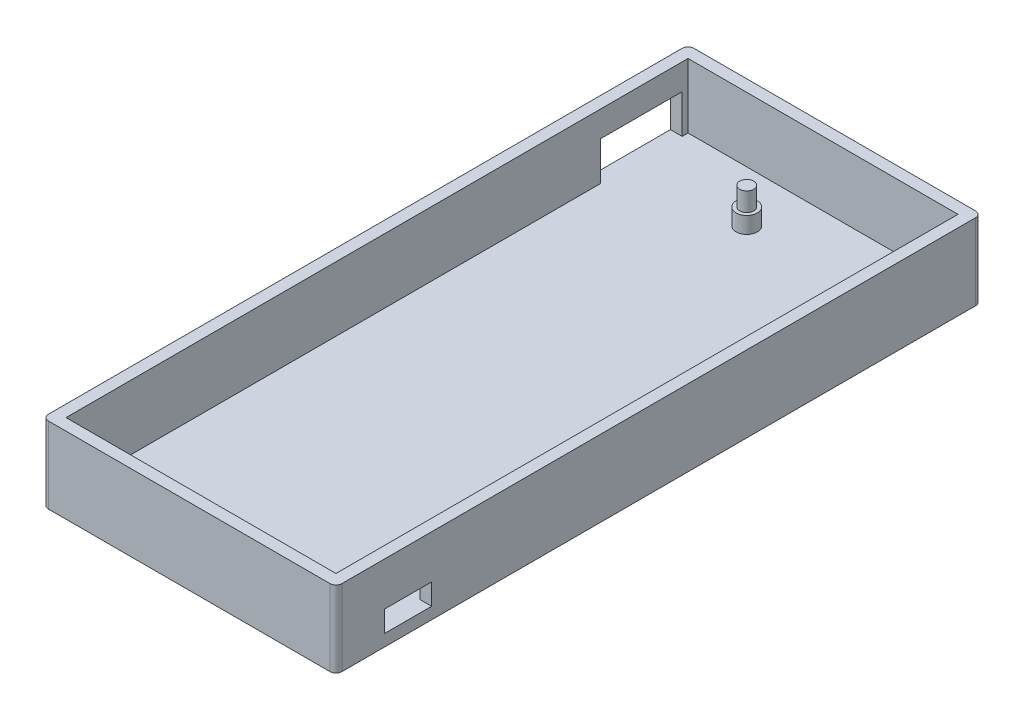
ISO-10303-21;
HEADER;
FILE_DESCRIPTION(('STEP AP214'),'2;1');
FILE_NAME('part.step','',(''),(''),'','','');
FILE_SCHEMA(('AUTOMOTIVE_DESIGN { 1 0 10303 214 1 1 1 1 }'));
ENDSEC;
DATA;
#1=APPLICATION_CONTEXT('core data for automotive mechanical design processes');
#2=APPLICATION_PROTOCOL_DEFINITION('international standard','automotive_design',2000,#1);
#3=PRODUCT_CONTEXT('',#1,'mechanical');
#4=PRODUCT('Part','Part','',(#3));
#5=PRODUCT_RELATED_PRODUCT_CATEGORY('part','',(#4));
#6=PRODUCT_DEFINITION_FORMATION('','',#4);
#7=PRODUCT_DEFINITION_CONTEXT('part definition',#1,'design');
#8=PRODUCT_DEFINITION('design','',#6,#7);
#9=PRODUCT_DEFINITION_SHAPE('','',#8);
#10=(LENGTH_UNIT() NAMED_UNIT(*) SI_UNIT(.MILLI.,.METRE.));
#11=(NAMED_UNIT(*) PLANE_ANGLE_UNIT() SI_UNIT($,.RADIAN.));
#12=(NAMED_UNIT(*) SI_UNIT($,.STERADIAN.) SOLID_ANGLE_UNIT());
#13=UNCERTAINTY_MEASURE_WITH_UNIT(LENGTH_MEASURE(1.E-05),#10,'distance_accuracy_value','');
#14=(GEOMETRIC_REPRESENTATION_CONTEXT(3) GLOBAL_UNCERTAINTY_ASSIGNED_CONTEXT((#13)) GLOBAL_UNIT_ASSIGNED_CONTEXT((#10,
#11,#12)) REPRESENTATION_CONTEXT('',''));
#15=CARTESIAN_POINT('',(0.,0.,0.));
#16=DIRECTION('',(0.,0.,1.));
#17=DIRECTION('',(1.,0.,0.));
#18=AXIS2_PLACEMENT_3D('',#15,#16,#17);
#19=CARTESIAN_POINT('',(0.,13.,0.));
#20=DIRECTION('',(0.,1.,0.));
#21=DIRECTION('',(0.,0.,1.));
#22=AXIS2_PLACEMENT_3D('',#19,#20,#21);
#23=PLANE('',#22);
#24=DIRECTION('',(0.,0.,1.));
#25=VECTOR('',#24,1.);
#26=CARTESIAN_POINT('',(-75.0225872689938,13.,-51.0800821355236));
#27=LINE('',#26,#25);
#28=CARTESIAN_POINT('',(-75.0225872689938,13.,-51.0800821355236));
#29=VERTEX_POINT('',#28);
#30=CARTESIAN_POINT('',(-75.0225872689938,13.,54.9199178644764));
#31=VERTEX_POINT('',#30);
#32=EDGE_CURVE('E459',#29,#31,#27,.T.);
#33=ORIENTED_EDGE('',*,*,#32,.F.);
#34=DIRECTION('',(-1.,0.,0.));
#35=VECTOR('',#34,1.);
#36=CARTESIAN_POINT('',(-75.0225872689938,13.,-51.0800821355236));
#37=LINE('',#36,#35);
#38=CARTESIAN_POINT('',(-29.0225872689938,13.,-51.0800821355236));
#39=VERTEX_POINT('',#38);
#40=EDGE_CURVE('E331',#39,#29,#37,.T.);
#41=ORIENTED_EDGE('',*,*,#40,.F.);
#42=DIRECTION('',(0.,0.,-1.));
#43=VECTOR('',#42,1.);
#44=CARTESIAN_POINT('',(-29.0225872689938,13.,-51.0800821355236));
#45=LINE('',#44,#43);
#46=CARTESIAN_POINT('',(-29.0225872689938,13.,54.9199178644764));
#47=VERTEX_POINT('',#46);
#48=EDGE_CURVE('E336',#47,#39,#45,.T.);
#49=ORIENTED_EDGE('',*,*,#48,.F.);
#50=DIRECTION('',(1.,0.,0.));
#51=VECTOR('',#50,1.);
#52=CARTESIAN_POINT('',(-75.0225872689938,13.,54.9199178644764));
#53=LINE('',#52,#51);
#54=EDGE_CURVE('E461',#31,#47,#53,.T.);
#55=ORIENTED_EDGE('',*,*,#54,.F.);
#56=EDGE_LOOP('',(#33,#41,#49,#55));
#57=FACE_BOUND('',#56,.T.);
#58=DIRECTION('',(-1.,0.,0.));
#59=VECTOR('',#58,1.);
#60=CARTESIAN_POINT('',(-28.0225872689938,13.,-53.0800821355236));
#61=LINE('',#60,#59);
#62=CARTESIAN_POINT('',(-28.0225872689938,13.,-53.0800821355236));
#63=VERTEX_POINT('',#62);
#64=CARTESIAN_POINT('',(-76.0225872689938,13.,-53.0800821355236));
#65=VERTEX_POINT('',#64);
#66=EDGE_CURVE('E530',#63,#65,#61,.T.);
#67=ORIENTED_EDGE('',*,*,#66,.T.);
#68=CARTESIAN_POINT('',(-76.0225872689938,13.,-52.0800821355236));
#69=DIRECTION('',(0.,1.,0.));
#70=DIRECTION('',(0.,0.,1.));
#71=AXIS2_PLACEMENT_3D('',#68,#69,#70);
#72=CIRCLE('',#71,1.00000000000001);
#73=CARTESIAN_POINT('',(-77.0225872689938,13.,-52.0800821355236));
#74=VERTEX_POINT('',#73);
#75=EDGE_CURVE('E390',#65,#74,#72,.T.);
#76=ORIENTED_EDGE('',*,*,#75,.T.);
#77=DIRECTION('',(0.,0.,1.));
#78=VECTOR('',#77,1.);
#79=CARTESIAN_POINT('',(-77.0225872689938,13.,-52.0800821355236));
#80=LINE('',#79,#78);
#81=CARTESIAN_POINT('',(-77.0225872689938,13.,55.9199178644764));
#82=VERTEX_POINT('',#81);
#83=EDGE_CURVE('E509',#74,#82,#80,.T.);
#84=ORIENTED_EDGE('',*,*,#83,.T.);
#85=CARTESIAN_POINT('',(-76.0225872689938,13.,55.9199178644764));
#86=DIRECTION('',(0.,1.,0.));
#87=DIRECTION('',(0.,0.,1.));
#88=AXIS2_PLACEMENT_3D('',#85,#86,#87);
#89=CIRCLE('',#88,1.);
#90=CARTESIAN_POINT('',(-76.0225872689938,13.,56.9199178644764));
#91=VERTEX_POINT('',#90);
#92=EDGE_CURVE('E168',#82,#91,#89,.T.);
#93=ORIENTED_EDGE('',*,*,#92,.T.);
#94=DIRECTION('',(1.,0.,0.));
#95=VECTOR('',#94,1.);
#96=CARTESIAN_POINT('',(-76.0225872689938,13.,56.9199178644764));
#97=LINE('',#96,#95);
#98=CARTESIAN_POINT('',(-28.0225872689938,13.,56.9199178644764));
#99=VERTEX_POINT('',#98);
#100=EDGE_CURVE('E518',#91,#99,#97,.T.);
#101=ORIENTED_EDGE('',*,*,#100,.T.);
#102=CARTESIAN_POINT('',(-28.0225872689938,13.,55.9199178644764));
#103=DIRECTION('',(0.,1.,0.));
#104=DIRECTION('',(0.,0.,1.));
#105=AXIS2_PLACEMENT_3D('',#102,#103,#104);
#106=CIRCLE('',#105,1.);
#107=CARTESIAN_POINT('',(-27.0225872689938,13.,55.9199178644764));
#108=VERTEX_POINT('',#107);
#109=EDGE_CURVE('E521',#99,#108,#106,.T.);
#110=ORIENTED_EDGE('',*,*,#109,.T.);
#111=DIRECTION('',(0.,0.,-1.));
#112=VECTOR('',#111,1.);
#113=CARTESIAN_POINT('',(-27.0225872689938,13.,55.9199178644764));
#114=LINE('',#113,#112);
#115=CARTESIAN_POINT('',(-27.0225872689938,13.,-52.0800821355236));
#116=VERTEX_POINT('',#115);
#117=EDGE_CURVE('E524',#108,#116,#114,.T.);
#118=ORIENTED_EDGE('',*,*,#117,.T.);
#119=CARTESIAN_POINT('',(-28.0225872689938,13.,-52.0800821355236));
#120=DIRECTION('',(0.,1.,0.));
#121=DIRECTION('',(0.,0.,1.));
#122=AXIS2_PLACEMENT_3D('',#119,#120,#121);
#123=CIRCLE('',#122,1.);
#124=EDGE_CURVE('E527',#116,#63,#123,.T.);
#125=ORIENTED_EDGE('',*,*,#124,.T.);
#126=EDGE_LOOP('',(#67,#76,#84,#93,#101,#110,#118,#125));
#127=FACE_BOUND('',#126,.T.);
#128=ADVANCED_FACE('F153',(#57,#127),#23,.T.);
#129=CARTESIAN_POINT('',(0.,2.,0.));
#130=DIRECTION('',(0.,1.,0.));
#131=DIRECTION('',(0.,0.,1.));
#132=AXIS2_PLACEMENT_3D('',#129,#130,#131);
#133=PLANE('',#132);
#134=DIRECTION('',(0.,0.,1.));
#135=VECTOR('',#134,1.);
#136=CARTESIAN_POINT('',(-75.0225872689938,2.,-51.0800821355236));
#137=LINE('',#136,#135);
#138=CARTESIAN_POINT('',(-75.0225872689938,2.,-51.0800821355236));
#139=VERTEX_POINT('',#138);
#140=CARTESIAN_POINT('',(-75.0225872689938,2.,-50.0800821355236));
#141=VERTEX_POINT('',#140);
#142=EDGE_CURVE('E318',#139,#141,#137,.T.);
#143=ORIENTED_EDGE('',*,*,#142,.T.);
#144=DIRECTION('',(-1.,0.,0.));
#145=VECTOR('',#144,1.);
#146=CARTESIAN_POINT('',(-75.0225872689938,2.,-50.0800821355236));
#147=LINE('',#146,#145);
#148=CARTESIAN_POINT('',(-77.0225872689938,2.,-50.0800821355236));
#149=VERTEX_POINT('',#148);
#150=EDGE_CURVE('E420',#141,#149,#147,.T.);
#151=ORIENTED_EDGE('',*,*,#150,.T.);
#152=DIRECTION('',(0.,0.,1.));
#153=VECTOR('',#152,1.);
#154=CARTESIAN_POINT('',(-77.0225872689938,2.,0.));
#155=LINE('',#154,#153);
#156=CARTESIAN_POINT('',(-77.0225872689938,2.,-36.1800821355236));
#157=VERTEX_POINT('',#156);
#158=EDGE_CURVE('E299',#149,#157,#155,.T.);
#159=ORIENTED_EDGE('',*,*,#158,.T.);
#160=DIRECTION('',(-1.,0.,0.));
#161=VECTOR('',#160,1.);
#162=CARTESIAN_POINT('',(-75.0225872689938,2.,-36.1800821355236));
#163=LINE('',#162,#161);
#164=CARTESIAN_POINT('',(-75.0225872689938,2.,-36.1800821355236));
#165=VERTEX_POINT('',#164);
#166=EDGE_CURVE('E289',#165,#157,#163,.T.);
#167=ORIENTED_EDGE('',*,*,#166,.F.);
#168=CARTESIAN_POINT('',(-75.0225872689938,2.,54.9199178644764));
#169=VERTEX_POINT('',#168);
#170=EDGE_CURVE('E296',#165,#169,#137,.T.);
#171=ORIENTED_EDGE('',*,*,#170,.T.);
#172=DIRECTION('',(1.,0.,0.));
#173=VECTOR('',#172,1.);
#174=CARTESIAN_POINT('',(-75.0225872689938,2.,54.9199178644764));
#175=LINE('',#174,#173);
#176=CARTESIAN_POINT('',(-29.0225872689938,2.,54.9199178644764));
#177=VERTEX_POINT('',#176);
#178=EDGE_CURVE('E321',#169,#177,#175,.T.);
#179=ORIENTED_EDGE('',*,*,#178,.T.);
#180=DIRECTION('',(0.,0.,-1.));
#181=VECTOR('',#180,1.);
#182=CARTESIAN_POINT('',(-29.0225872689938,2.,-51.0800821355236));
#183=LINE('',#182,#181);
#184=CARTESIAN_POINT('',(-29.0225872689938,2.,48.6199178644764));
#185=VERTEX_POINT('',#184);
#186=EDGE_CURVE('E328',#177,#185,#183,.T.);
#187=ORIENTED_EDGE('',*,*,#186,.T.);
#188=DIRECTION('',(1.,0.,0.));
#189=VECTOR('',#188,1.);
#190=CARTESIAN_POINT('',(-38.8225872689938,2.,48.6199178644764));
#191=LINE('',#190,#189);
#192=CARTESIAN_POINT('',(-27.0225872689938,2.,48.6199178644764));
#193=VERTEX_POINT('',#192);
#194=EDGE_CURVE('E422',#185,#193,#191,.T.);
#195=ORIENTED_EDGE('',*,*,#194,.T.);
#196=DIRECTION('',(0.,0.,-1.));
#197=VECTOR('',#196,1.);
#198=CARTESIAN_POINT('',(-27.0225872689938,2.,0.));
#199=LINE('',#198,#197);
#200=CARTESIAN_POINT('',(-27.0225872689938,2.,40.6199178644764));
#201=VERTEX_POINT('',#200);
#202=EDGE_CURVE('E405',#193,#201,#199,.T.);
#203=ORIENTED_EDGE('',*,*,#202,.T.);
#204=DIRECTION('',(1.,0.,0.));
#205=VECTOR('',#204,1.);
#206=CARTESIAN_POINT('',(-38.8225872689938,2.,40.6199178644764));
#207=LINE('',#206,#205);
#208=CARTESIAN_POINT('',(-29.0225872689938,2.,40.6199178644764));
#209=VERTEX_POINT('',#208);
#210=EDGE_CURVE('E430',#209,#201,#207,.T.);
#211=ORIENTED_EDGE('',*,*,#210,.F.);
#212=CARTESIAN_POINT('',(-29.0225872689938,2.,-51.0800821355236));
#213=VERTEX_POINT('',#212);
#214=EDGE_CURVE('E327',#209,#213,#183,.T.);
#215=ORIENTED_EDGE('',*,*,#214,.T.);
#216=DIRECTION('',(-1.,0.,0.));
#217=VECTOR('',#216,1.);
#218=CARTESIAN_POINT('',(-75.0225872689938,2.,-51.0800821355236));
#219=LINE('',#218,#217);
#220=EDGE_CURVE('E319',#213,#139,#219,.T.);
#221=ORIENTED_EDGE('',*,*,#220,.T.);
#222=EDGE_LOOP('',(#143,#151,#159,#167,#171,#179,#187,#195,#203,#211,#215,#221));
#223=FACE_BOUND('',#222,.T.);
#224=CARTESIAN_POINT('',(-31.0225872689938,2.,-42.3800821355236));
#225=DIRECTION('',(0.,1.,0.));
#226=DIRECTION('',(0.,0.,1.));
#227=AXIS2_PLACEMENT_3D('',#224,#225,#226);
#228=CIRCLE('',#227,1.8);
#229=CARTESIAN_POINT('',(-31.0225872689938,2.,-40.5800821355236));
#230=VERTEX_POINT('',#229);
#231=EDGE_CURVE('E441',#230,#230,#228,.T.);
#232=ORIENTED_EDGE('',*,*,#231,.F.);
#233=EDGE_LOOP('',(#232));
#234=FACE_BOUND('',#233,.T.);
#235=CARTESIAN_POINT('',(-56.3225872689938,2.,-42.3800821355236));
#236=DIRECTION('',(0.,1.,0.));
#237=DIRECTION('',(0.,0.,1.));
#238=AXIS2_PLACEMENT_3D('',#235,#236,#237);
#239=CIRCLE('',#238,1.8);
#240=CARTESIAN_POINT('',(-56.3225872689938,2.,-40.5800821355236));
#241=VERTEX_POINT('',#240);
#242=EDGE_CURVE('E359',#241,#241,#239,.T.);
#243=ORIENTED_EDGE('',*,*,#242,.F.);
#244=EDGE_LOOP('',(#243));
#245=FACE_BOUND('',#244,.T.);
#246=CARTESIAN_POINT('',(-31.0225872689938,2.,52.9199178644764));
#247=DIRECTION('',(0.,1.,0.));
#248=DIRECTION('',(0.,0.,1.));
#249=AXIS2_PLACEMENT_3D('',#246,#247,#248);
#250=CIRCLE('',#249,1.8);
#251=CARTESIAN_POINT('',(-31.0225872689938,2.,54.7199178644764));
#252=VERTEX_POINT('',#251);
#253=EDGE_CURVE('E354',#252,#252,#250,.T.);
#254=ORIENTED_EDGE('',*,*,#253,.F.);
#255=EDGE_LOOP('',(#254));
#256=FACE_BOUND('',#255,.T.);
#257=CARTESIAN_POINT('',(-56.3225872689938,2.,52.9199178644764));
#258=DIRECTION('',(0.,1.,0.));
#259=DIRECTION('',(0.,0.,1.));
#260=AXIS2_PLACEMENT_3D('',#257,#258,#259);
#261=CIRCLE('',#260,1.8);
#262=CARTESIAN_POINT('',(-56.3225872689938,2.,54.7199178644764));
#263=VERTEX_POINT('',#262);
#264=EDGE_CURVE('E349',#263,#263,#261,.T.);
#265=ORIENTED_EDGE('',*,*,#264,.F.);
#266=EDGE_LOOP('',(#265));
#267=FACE_BOUND('',#266,.T.);
#268=ADVANCED_FACE('F292',(#223,#234,#245,#256,#267),#133,.T.);
#269=CARTESIAN_POINT('',(-38.8225872689938,2.,48.6199178644764));
#270=DIRECTION('',(0.,0.,1.));
#271=DIRECTION('',(1.,0.,0.));
#272=AXIS2_PLACEMENT_3D('',#269,#270,#271);
#273=PLANE('',#272);
#274=DIRECTION('',(0.,1.,0.));
#275=VECTOR('',#274,1.);
#276=CARTESIAN_POINT('',(-27.0225872689938,2.,48.6199178644764));
#277=LINE('',#276,#275);
#278=CARTESIAN_POINT('',(-27.0225872689938,5.6,48.6199178644764));
#279=VERTEX_POINT('',#278);
#280=EDGE_CURVE('E399',#193,#279,#277,.T.);
#281=ORIENTED_EDGE('',*,*,#280,.F.);
#282=ORIENTED_EDGE('',*,*,#194,.F.);
#283=DIRECTION('',(0.,1.,0.));
#284=VECTOR('',#283,1.);
#285=CARTESIAN_POINT('',(-29.0225872689938,13.,48.6199178644764));
#286=LINE('',#285,#284);
#287=CARTESIAN_POINT('',(-29.0225872689938,5.6,48.6199178644764));
#288=VERTEX_POINT('',#287);
#289=EDGE_CURVE('E439',#185,#288,#286,.T.);
#290=ORIENTED_EDGE('',*,*,#289,.T.);
#291=DIRECTION('',(1.,0.,0.));
#292=VECTOR('',#291,1.);
#293=CARTESIAN_POINT('',(-38.8225872689938,5.6,48.6199178644764));
#294=LINE('',#293,#292);
#295=EDGE_CURVE('E423',#288,#279,#294,.T.);
#296=ORIENTED_EDGE('',*,*,#295,.T.);
#297=EDGE_LOOP('',(#281,#282,#290,#296));
#298=FACE_BOUND('',#297,.T.);
#299=ADVANCED_FACE('F487',(#298),#273,.F.);
#300=CARTESIAN_POINT('',(-38.8225872689938,5.6,48.6199178644764));
#301=DIRECTION('',(0.,1.,0.));
#302=DIRECTION('',(0.,0.,1.));
#303=AXIS2_PLACEMENT_3D('',#300,#301,#302);
#304=PLANE('',#303);
#305=DIRECTION('',(0.,0.,-1.));
#306=VECTOR('',#305,1.);
#307=CARTESIAN_POINT('',(-27.0225872689938,5.6,48.6199178644764));
#308=LINE('',#307,#306);
#309=CARTESIAN_POINT('',(-27.0225872689938,5.6,40.6199178644764));
#310=VERTEX_POINT('',#309);
#311=EDGE_CURVE('E397',#279,#310,#308,.T.);
#312=ORIENTED_EDGE('',*,*,#311,.F.);
#313=ORIENTED_EDGE('',*,*,#295,.F.);
#314=DIRECTION('',(0.,0.,-1.));
#315=VECTOR('',#314,1.);
#316=CARTESIAN_POINT('',(-29.0225872689938,5.6,-51.0800821355236));
#317=LINE('',#316,#315);
#318=CARTESIAN_POINT('',(-29.0225872689938,5.6,40.6199178644764));
#319=VERTEX_POINT('',#318);
#320=EDGE_CURVE('E437',#288,#319,#317,.T.);
#321=ORIENTED_EDGE('',*,*,#320,.T.);
#322=DIRECTION('',(1.,0.,0.));
#323=VECTOR('',#322,1.);
#324=CARTESIAN_POINT('',(-38.8225872689938,5.6,40.6199178644764));
#325=LINE('',#324,#323);
#326=EDGE_CURVE('E427',#319,#310,#325,.T.);
#327=ORIENTED_EDGE('',*,*,#326,.T.);
#328=EDGE_LOOP('',(#312,#313,#321,#327));
#329=FACE_BOUND('',#328,.T.);
#330=ADVANCED_FACE('F490',(#329),#304,.F.);
#331=CARTESIAN_POINT('',(-38.8225872689938,2.,40.6199178644764));
#332=DIRECTION('',(0.,0.,-1.));
#333=DIRECTION('',(-1.,0.,0.));
#334=AXIS2_PLACEMENT_3D('',#331,#332,#333);
#335=PLANE('',#334);
#336=DIRECTION('',(0.,-1.,0.));
#337=VECTOR('',#336,1.);
#338=CARTESIAN_POINT('',(-27.0225872689938,2.,40.6199178644764));
#339=LINE('',#338,#337);
#340=EDGE_CURVE('E342',#310,#201,#339,.T.);
#341=ORIENTED_EDGE('',*,*,#340,.F.);
#342=ORIENTED_EDGE('',*,*,#326,.F.);
#343=DIRECTION('',(0.,-1.,0.));
#344=VECTOR('',#343,1.);
#345=CARTESIAN_POINT('',(-29.0225872689938,13.,40.6199178644764));
#346=LINE('',#345,#344);
#347=EDGE_CURVE('E426',#319,#209,#346,.T.);
#348=ORIENTED_EDGE('',*,*,#347,.T.);
#349=ORIENTED_EDGE('',*,*,#210,.T.);
#350=EDGE_LOOP('',(#341,#342,#348,#349));
#351=FACE_BOUND('',#350,.T.);
#352=ADVANCED_FACE('F497',(#351),#335,.F.);
#353=CARTESIAN_POINT('',(-75.0225872689938,7.8,-50.0800821355236));
#354=DIRECTION('',(0.,0.,-1.));
#355=DIRECTION('',(-1.,0.,0.));
#356=AXIS2_PLACEMENT_3D('',#353,#354,#355);
#357=PLANE('',#356);
#358=DIRECTION('',(0.,1.,0.));
#359=VECTOR('',#358,1.);
#360=CARTESIAN_POINT('',(-77.0225872689938,7.8,-50.0800821355236));
#361=LINE('',#360,#359);
#362=CARTESIAN_POINT('',(-77.0225872689938,8.6,-50.0800821355236));
#363=VERTEX_POINT('',#362);
#364=EDGE_CURVE('E392',#149,#363,#361,.T.);
#365=ORIENTED_EDGE('',*,*,#364,.F.);
#366=ORIENTED_EDGE('',*,*,#150,.F.);
#367=DIRECTION('',(0.,-1.,0.));
#368=VECTOR('',#367,1.);
#369=CARTESIAN_POINT('',(-75.0225872689938,7.8,-50.0800821355236));
#370=LINE('',#369,#368);
#371=CARTESIAN_POINT('',(-75.0225872689938,8.6,-50.0800821355236));
#372=VERTEX_POINT('',#371);
#373=EDGE_CURVE('E417',#372,#141,#370,.T.);
#374=ORIENTED_EDGE('',*,*,#373,.F.);
#375=DIRECTION('',(-1.,0.,0.));
#376=VECTOR('',#375,1.);
#377=CARTESIAN_POINT('',(-75.0225872689938,8.6,-50.0800821355236));
#378=LINE('',#377,#376);
#379=EDGE_CURVE('E503',#372,#363,#378,.T.);
#380=ORIENTED_EDGE('',*,*,#379,.T.);
#381=EDGE_LOOP('',(#365,#366,#374,#380));
#382=FACE_BOUND('',#381,.T.);
#383=ADVANCED_FACE('F502',(#382),#357,.F.);
#384=CARTESIAN_POINT('',(-75.0225872689938,13.,-51.0800821355236));
#385=DIRECTION('',(0.,0.,1.));
#386=DIRECTION('',(1.,0.,0.));
#387=AXIS2_PLACEMENT_3D('',#384,#385,#386);
#388=PLANE('',#387);
#389=ORIENTED_EDGE('',*,*,#220,.F.);
#390=DIRECTION('',(0.,-1.,0.));
#391=VECTOR('',#390,1.);
#392=CARTESIAN_POINT('',(-29.0225872689938,13.,-51.0800821355236));
#393=LINE('',#392,#391);
#394=EDGE_CURVE('E332',#39,#213,#393,.T.);
#395=ORIENTED_EDGE('',*,*,#394,.F.);
#396=ORIENTED_EDGE('',*,*,#40,.T.);
#397=DIRECTION('',(0.,-1.,0.));
#398=VECTOR('',#397,1.);
#399=CARTESIAN_POINT('',(-75.0225872689938,13.,-51.0800821355236));
#400=LINE('',#399,#398);
#401=EDGE_CURVE('E339',#29,#139,#400,.T.);
#402=ORIENTED_EDGE('',*,*,#401,.T.);
#403=EDGE_LOOP('',(#389,#395,#396,#402));
#404=FACE_BOUND('',#403,.T.);
#405=ADVANCED_FACE('F474',(#404),#388,.T.);
#406=CARTESIAN_POINT('',(-75.0225872689938,13.,-51.0800821355236));
#407=DIRECTION('',(1.,0.,0.));
#408=DIRECTION('',(0.,0.,-1.));
#409=AXIS2_PLACEMENT_3D('',#406,#407,#408);
#410=PLANE('',#409);
#411=DIRECTION('',(0.,0.,-1.));
#412=VECTOR('',#411,1.);
#413=CARTESIAN_POINT('',(-75.0225872689938,8.6,-50.0800821355236));
#414=LINE('',#413,#412);
#415=CARTESIAN_POINT('',(-75.0225872689938,8.6,-36.1800821355236));
#416=VERTEX_POINT('',#415);
#417=EDGE_CURVE('E304',#416,#372,#414,.T.);
#418=ORIENTED_EDGE('',*,*,#417,.T.);
#419=ORIENTED_EDGE('',*,*,#373,.T.);
#420=ORIENTED_EDGE('',*,*,#142,.F.);
#421=ORIENTED_EDGE('',*,*,#401,.F.);
#422=ORIENTED_EDGE('',*,*,#32,.T.);
#423=DIRECTION('',(0.,-1.,0.));
#424=VECTOR('',#423,1.);
#425=CARTESIAN_POINT('',(-75.0225872689938,13.,54.9199178644764));
#426=LINE('',#425,#424);
#427=EDGE_CURVE('E316',#31,#169,#426,.T.);
#428=ORIENTED_EDGE('',*,*,#427,.T.);
#429=ORIENTED_EDGE('',*,*,#170,.F.);
#430=DIRECTION('',(0.,1.,0.));
#431=VECTOR('',#430,1.);
#432=CARTESIAN_POINT('',(-75.0225872689938,2.,-36.1800821355236));
#433=LINE('',#432,#431);
#434=EDGE_CURVE('E307',#165,#416,#433,.T.);
#435=ORIENTED_EDGE('',*,*,#434,.T.);
#436=EDGE_LOOP('',(#418,#419,#420,#421,#422,#428,#429,#435));
#437=FACE_BOUND('',#436,.T.);
#438=ADVANCED_FACE('F314',(#437),#410,.T.);
#439=CARTESIAN_POINT('',(-75.0225872689938,13.,54.9199178644764));
#440=DIRECTION('',(0.,0.,-1.));
#441=DIRECTION('',(-1.,0.,0.));
#442=AXIS2_PLACEMENT_3D('',#439,#440,#441);
#443=PLANE('',#442);
#444=ORIENTED_EDGE('',*,*,#54,.T.);
#445=DIRECTION('',(0.,-1.,0.));
#446=VECTOR('',#445,1.);
#447=CARTESIAN_POINT('',(-29.0225872689938,13.,54.9199178644764));
#448=LINE('',#447,#446);
#449=EDGE_CURVE('E335',#47,#177,#448,.T.);
#450=ORIENTED_EDGE('',*,*,#449,.T.);
#451=ORIENTED_EDGE('',*,*,#178,.F.);
#452=ORIENTED_EDGE('',*,*,#427,.F.);
#453=EDGE_LOOP('',(#444,#450,#451,#452));
#454=FACE_BOUND('',#453,.T.);
#455=ADVANCED_FACE('F480',(#454),#443,.T.);
#456=CARTESIAN_POINT('',(-29.0225872689938,13.,-51.0800821355236));
#457=DIRECTION('',(-1.,0.,0.));
#458=DIRECTION('',(0.,0.,1.));
#459=AXIS2_PLACEMENT_3D('',#456,#457,#458);
#460=PLANE('',#459);
#461=ORIENTED_EDGE('',*,*,#48,.T.);
#462=ORIENTED_EDGE('',*,*,#394,.T.);
#463=ORIENTED_EDGE('',*,*,#214,.F.);
#464=ORIENTED_EDGE('',*,*,#347,.F.);
#465=ORIENTED_EDGE('',*,*,#320,.F.);
#466=ORIENTED_EDGE('',*,*,#289,.F.);
#467=ORIENTED_EDGE('',*,*,#186,.F.);
#468=ORIENTED_EDGE('',*,*,#449,.F.);
#469=EDGE_LOOP('',(#461,#462,#463,#464,#465,#466,#467,#468));
#470=FACE_BOUND('',#469,.T.);
#471=ADVANCED_FACE('F466',(#470),#460,.T.);
#472=CARTESIAN_POINT('',(-56.3225872689938,4.8,52.9199178644764));
#473=DIRECTION('',(0.,-1.,0.));
#474=DIRECTION('',(0.,0.,-1.));
#475=AXIS2_PLACEMENT_3D('',#472,#473,#474);
#476=CYLINDRICAL_SURFACE('',#475,1.8);
#477=CARTESIAN_POINT('',(-56.3225872689938,4.8,52.9199178644764));
#478=DIRECTION('',(0.,1.,0.));
#479=DIRECTION('',(0.,0.,1.));
#480=AXIS2_PLACEMENT_3D('',#477,#478,#479);
#481=CIRCLE('',#480,1.8);
#482=CARTESIAN_POINT('',(-56.3225872689938,4.8,54.7199178644764));
#483=VERTEX_POINT('',#482);
#484=EDGE_CURVE('E345',#483,#483,#481,.T.);
#485=ORIENTED_EDGE('',*,*,#484,.F.);
#486=EDGE_LOOP('',(#485));
#487=FACE_BOUND('',#486,.T.);
#488=ORIENTED_EDGE('',*,*,#264,.T.);
#489=EDGE_LOOP('',(#488));
#490=FACE_BOUND('',#489,.T.);
#491=ADVANCED_FACE('F573',(#487,#490),#476,.T.);
#492=CARTESIAN_POINT('',(-56.3225872689938,4.8,52.9199178644764));
#493=DIRECTION('',(0.,1.,0.));
#494=DIRECTION('',(0.,0.,1.));
#495=AXIS2_PLACEMENT_3D('',#492,#493,#494);
#496=PLANE('',#495);
#497=CARTESIAN_POINT('',(-56.3225872689938,4.8,52.9199178644764));
#498=DIRECTION('',(0.,1.,0.));
#499=DIRECTION('',(0.,0.,1.));
#500=AXIS2_PLACEMENT_3D('',#497,#498,#499);
#501=CIRCLE('',#500,1.2);
#502=CARTESIAN_POINT('',(-56.3225872689938,4.8,54.1199178644764));
#503=VERTEX_POINT('',#502);
#504=EDGE_CURVE('E322',#503,#503,#501,.T.);
#505=ORIENTED_EDGE('',*,*,#504,.F.);
#506=EDGE_LOOP('',(#505));
#507=FACE_BOUND('',#506,.T.);
#508=ORIENTED_EDGE('',*,*,#484,.T.);
#509=EDGE_LOOP('',(#508));
#510=FACE_BOUND('',#509,.T.);
#511=ADVANCED_FACE('F596',(#507,#510),#496,.T.);
#512=CARTESIAN_POINT('',(-56.3225872689938,13.,52.9199178644764));
#513=DIRECTION('',(0.,-1.,0.));
#514=DIRECTION('',(0.,0.,-1.));
#515=AXIS2_PLACEMENT_3D('',#512,#513,#514);
#516=CYLINDRICAL_SURFACE('',#515,1.2);
#517=CARTESIAN_POINT('',(-56.3225872689938,8.,52.9199178644764));
#518=DIRECTION('',(0.,-1.,0.));
#519=DIRECTION('',(0.,0.,-1.));
#520=AXIS2_PLACEMENT_3D('',#517,#518,#519);
#521=CIRCLE('',#520,1.2);
#522=CARTESIAN_POINT('',(-56.3225872689938,8.,51.7199178644764));
#523=VERTEX_POINT('',#522);
#524=EDGE_CURVE('E414',#523,#523,#521,.T.);
#525=ORIENTED_EDGE('',*,*,#524,.T.);
#526=EDGE_LOOP('',(#525));
#527=FACE_BOUND('',#526,.T.);
#528=ORIENTED_EDGE('',*,*,#504,.T.);
#529=EDGE_LOOP('',(#528));
#530=FACE_BOUND('',#529,.T.);
#531=ADVANCED_FACE('F592',(#527,#530),#516,.T.);
#532=CARTESIAN_POINT('',(-31.0225872689938,4.8,52.9199178644764));
#533=DIRECTION('',(0.,-1.,0.));
#534=DIRECTION('',(0.,0.,-1.));
#535=AXIS2_PLACEMENT_3D('',#532,#533,#534);
#536=CYLINDRICAL_SURFACE('',#535,1.8);
#537=CARTESIAN_POINT('',(-31.0225872689938,4.8,52.9199178644764));
#538=DIRECTION('',(0.,1.,0.));
#539=DIRECTION('',(0.,0.,1.));
#540=AXIS2_PLACEMENT_3D('',#537,#538,#539);
#541=CIRCLE('',#540,1.8);
#542=CARTESIAN_POINT('',(-31.0225872689938,4.8,54.7199178644764));
#543=VERTEX_POINT('',#542);
#544=EDGE_CURVE('E350',#543,#543,#541,.T.);
#545=ORIENTED_EDGE('',*,*,#544,.F.);
#546=EDGE_LOOP('',(#545));
#547=FACE_BOUND('',#546,.T.);
#548=ORIENTED_EDGE('',*,*,#253,.T.);
#549=EDGE_LOOP('',(#548));
#550=FACE_BOUND('',#549,.T.);
#551=ADVANCED_FACE('F595',(#547,#550),#536,.T.);
#552=CARTESIAN_POINT('',(-31.0225872689938,4.8,52.9199178644764));
#553=DIRECTION('',(0.,1.,0.));
#554=DIRECTION('',(0.,0.,1.));
#555=AXIS2_PLACEMENT_3D('',#552,#553,#554);
#556=PLANE('',#555);
#557=CARTESIAN_POINT('',(-31.0225872689938,4.8,52.9199178644764));
#558=DIRECTION('',(0.,1.,0.));
#559=DIRECTION('',(0.,0.,1.));
#560=AXIS2_PLACEMENT_3D('',#557,#558,#559);
#561=CIRCLE('',#560,1.2);
#562=CARTESIAN_POINT('',(-31.0225872689938,4.8,54.1199178644764));
#563=VERTEX_POINT('',#562);
#564=EDGE_CURVE('E346',#563,#563,#561,.T.);
#565=ORIENTED_EDGE('',*,*,#564,.F.);
#566=EDGE_LOOP('',(#565));
#567=FACE_BOUND('',#566,.T.);
#568=ORIENTED_EDGE('',*,*,#544,.T.);
#569=EDGE_LOOP('',(#568));
#570=FACE_BOUND('',#569,.T.);
#571=ADVANCED_FACE('F584',(#567,#570),#556,.T.);
#572=CARTESIAN_POINT('',(-31.0225872689938,13.,52.9199178644764));
#573=DIRECTION('',(0.,-1.,0.));
#574=DIRECTION('',(0.,0.,-1.));
#575=AXIS2_PLACEMENT_3D('',#572,#573,#574);
#576=CYLINDRICAL_SURFACE('',#575,1.2);
#577=CARTESIAN_POINT('',(-31.0225872689938,8.,52.9199178644764));
#578=DIRECTION('',(0.,-1.,0.));
#579=DIRECTION('',(0.,0.,-1.));
#580=AXIS2_PLACEMENT_3D('',#577,#578,#579);
#581=CIRCLE('',#580,1.2);
#582=CARTESIAN_POINT('',(-31.0225872689938,8.,51.7199178644764));
#583=VERTEX_POINT('',#582);
#584=EDGE_CURVE('E411',#583,#583,#581,.T.);
#585=ORIENTED_EDGE('',*,*,#584,.T.);
#586=EDGE_LOOP('',(#585));
#587=FACE_BOUND('',#586,.T.);
#588=ORIENTED_EDGE('',*,*,#564,.T.);
#589=EDGE_LOOP('',(#588));
#590=FACE_BOUND('',#589,.T.);
#591=ADVANCED_FACE('F580',(#587,#590),#576,.T.);
#592=CARTESIAN_POINT('',(-56.3225872689938,4.8,-42.3800821355236));
#593=DIRECTION('',(0.,-1.,0.));
#594=DIRECTION('',(0.,0.,-1.));
#595=AXIS2_PLACEMENT_3D('',#592,#593,#594);
#596=CYLINDRICAL_SURFACE('',#595,1.8);
#597=CARTESIAN_POINT('',(-56.3225872689938,4.8,-42.3800821355236));
#598=DIRECTION('',(0.,1.,0.));
#599=DIRECTION('',(0.,0.,1.));
#600=AXIS2_PLACEMENT_3D('',#597,#598,#599);
#601=CIRCLE('',#600,1.8);
#602=CARTESIAN_POINT('',(-56.3225872689938,4.8,-40.5800821355236));
#603=VERTEX_POINT('',#602);
#604=EDGE_CURVE('E355',#603,#603,#601,.T.);
#605=ORIENTED_EDGE('',*,*,#604,.F.);
#606=EDGE_LOOP('',(#605));
#607=FACE_BOUND('',#606,.T.);
#608=ORIENTED_EDGE('',*,*,#242,.T.);
#609=EDGE_LOOP('',(#608));
#610=FACE_BOUND('',#609,.T.);
#611=ADVANCED_FACE('F583',(#607,#610),#596,.T.);
#612=CARTESIAN_POINT('',(-56.3225872689938,4.8,-42.3800821355236));
#613=DIRECTION('',(0.,1.,0.));
#614=DIRECTION('',(0.,0.,1.));
#615=AXIS2_PLACEMENT_3D('',#612,#613,#614);
#616=PLANE('',#615);
#617=CARTESIAN_POINT('',(-56.3225872689938,4.8,-42.3800821355236));
#618=DIRECTION('',(0.,1.,0.));
#619=DIRECTION('',(0.,0.,1.));
#620=AXIS2_PLACEMENT_3D('',#617,#618,#619);
#621=CIRCLE('',#620,1.2);
#622=CARTESIAN_POINT('',(-56.3225872689938,4.8,-41.1800821355236));
#623=VERTEX_POINT('',#622);
#624=EDGE_CURVE('E351',#623,#623,#621,.T.);
#625=ORIENTED_EDGE('',*,*,#624,.F.);
#626=EDGE_LOOP('',(#625));
#627=FACE_BOUND('',#626,.T.);
#628=ORIENTED_EDGE('',*,*,#604,.T.);
#629=EDGE_LOOP('',(#628));
#630=FACE_BOUND('',#629,.T.);
#631=ADVANCED_FACE('F590',(#627,#630),#616,.T.);
#632=CARTESIAN_POINT('',(-56.3225872689938,13.,-42.3800821355236));
#633=DIRECTION('',(0.,-1.,0.));
#634=DIRECTION('',(0.,0.,-1.));
#635=AXIS2_PLACEMENT_3D('',#632,#633,#634);
#636=CYLINDRICAL_SURFACE('',#635,1.2);
#637=CARTESIAN_POINT('',(-56.3225872689938,8.,-42.3800821355236));
#638=DIRECTION('',(0.,-1.,0.));
#639=DIRECTION('',(0.,0.,-1.));
#640=AXIS2_PLACEMENT_3D('',#637,#638,#639);
#641=CIRCLE('',#640,1.2);
#642=CARTESIAN_POINT('',(-56.3225872689938,8.,-43.5800821355236));
#643=VERTEX_POINT('',#642);
#644=EDGE_CURVE('E364',#643,#643,#641,.T.);
#645=ORIENTED_EDGE('',*,*,#644,.T.);
#646=EDGE_LOOP('',(#645));
#647=FACE_BOUND('',#646,.T.);
#648=ORIENTED_EDGE('',*,*,#624,.T.);
#649=EDGE_LOOP('',(#648));
#650=FACE_BOUND('',#649,.T.);
#651=ADVANCED_FACE('F586',(#647,#650),#636,.T.);
#652=CARTESIAN_POINT('',(-31.0225872689938,4.8,-42.3800821355236));
#653=DIRECTION('',(0.,-1.,0.));
#654=DIRECTION('',(0.,0.,-1.));
#655=AXIS2_PLACEMENT_3D('',#652,#653,#654);
#656=CYLINDRICAL_SURFACE('',#655,1.8);
#657=CARTESIAN_POINT('',(-31.0225872689938,4.8,-42.3800821355236));
#658=DIRECTION('',(0.,1.,0.));
#659=DIRECTION('',(0.,0.,1.));
#660=AXIS2_PLACEMENT_3D('',#657,#658,#659);
#661=CIRCLE('',#660,1.8);
#662=CARTESIAN_POINT('',(-31.0225872689938,4.8,-40.5800821355236));
#663=VERTEX_POINT('',#662);
#664=EDGE_CURVE('E360',#663,#663,#661,.T.);
#665=ORIENTED_EDGE('',*,*,#664,.F.);
#666=EDGE_LOOP('',(#665));
#667=FACE_BOUND('',#666,.T.);
#668=ORIENTED_EDGE('',*,*,#231,.T.);
#669=EDGE_LOOP('',(#668));
#670=FACE_BOUND('',#669,.T.);
#671=ADVANCED_FACE('F589',(#667,#670),#656,.T.);
#672=CARTESIAN_POINT('',(-31.0225872689938,4.8,-42.3800821355236));
#673=DIRECTION('',(0.,1.,0.));
#674=DIRECTION('',(0.,0.,1.));
#675=AXIS2_PLACEMENT_3D('',#672,#673,#674);
#676=PLANE('',#675);
#677=CARTESIAN_POINT('',(-31.0225872689938,4.8,-42.3800821355236));
#678=DIRECTION('',(0.,1.,0.));
#679=DIRECTION('',(0.,0.,1.));
#680=AXIS2_PLACEMENT_3D('',#677,#678,#679);
#681=CIRCLE('',#680,1.2);
#682=CARTESIAN_POINT('',(-31.0225872689938,4.8,-41.1800821355236));
#683=VERTEX_POINT('',#682);
#684=EDGE_CURVE('E356',#683,#683,#681,.T.);
#685=ORIENTED_EDGE('',*,*,#684,.F.);
#686=EDGE_LOOP('',(#685));
#687=FACE_BOUND('',#686,.T.);
#688=ORIENTED_EDGE('',*,*,#664,.T.);
#689=EDGE_LOOP('',(#688));
#690=FACE_BOUND('',#689,.T.);
#691=ADVANCED_FACE('F578',(#687,#690),#676,.T.);
#692=CARTESIAN_POINT('',(-31.0225872689938,13.,-42.3800821355236));
#693=DIRECTION('',(0.,-1.,0.));
#694=DIRECTION('',(0.,0.,-1.));
#695=AXIS2_PLACEMENT_3D('',#692,#693,#694);
#696=CYLINDRICAL_SURFACE('',#695,1.2);
#697=CARTESIAN_POINT('',(-31.0225872689938,8.,-42.3800821355236));
#698=DIRECTION('',(0.,-1.,0.));
#699=DIRECTION('',(0.,0.,-1.));
#700=AXIS2_PLACEMENT_3D('',#697,#698,#699);
#701=CIRCLE('',#700,1.2);
#702=CARTESIAN_POINT('',(-31.0225872689938,8.,-43.5800821355236));
#703=VERTEX_POINT('',#702);
#704=EDGE_CURVE('E361',#703,#703,#701,.T.);
#705=ORIENTED_EDGE('',*,*,#704,.T.);
#706=EDGE_LOOP('',(#705));
#707=FACE_BOUND('',#706,.T.);
#708=ORIENTED_EDGE('',*,*,#684,.T.);
#709=EDGE_LOOP('',(#708));
#710=FACE_BOUND('',#709,.T.);
#711=ADVANCED_FACE('F574',(#707,#710),#696,.T.);
#712=CARTESIAN_POINT('',(0.,8.,0.));
#713=DIRECTION('',(0.,-1.,0.));
#714=DIRECTION('',(0.,0.,-1.));
#715=AXIS2_PLACEMENT_3D('',#712,#713,#714);
#716=PLANE('',#715);
#717=ORIENTED_EDGE('',*,*,#704,.F.);
#718=EDGE_LOOP('',(#717));
#719=FACE_BOUND('',#718,.T.);
#720=ADVANCED_FACE('F577',(#719),#716,.F.);
#721=ORIENTED_EDGE('',*,*,#644,.F.);
#722=EDGE_LOOP('',(#721));
#723=FACE_BOUND('',#722,.T.);
#724=ADVANCED_FACE('F875',(#723),#716,.F.);
#725=ORIENTED_EDGE('',*,*,#584,.F.);
#726=EDGE_LOOP('',(#725));
#727=FACE_BOUND('',#726,.T.);
#728=ADVANCED_FACE('F632',(#727),#716,.F.);
#729=ORIENTED_EDGE('',*,*,#524,.F.);
#730=EDGE_LOOP('',(#729));
#731=FACE_BOUND('',#730,.T.);
#732=ADVANCED_FACE('F630',(#731),#716,.F.);
#733=CARTESIAN_POINT('',(-76.0225872689938,-42.,-52.0800821355236));
#734=DIRECTION('',(0.,1.,0.));
#735=DIRECTION('',(0.,0.,1.));
#736=AXIS2_PLACEMENT_3D('',#733,#734,#735);
#737=CYLINDRICAL_SURFACE('',#736,1.00000000000001);
#738=CARTESIAN_POINT('',(-76.0225872689938,0.,-52.0800821355236));
#739=DIRECTION('',(0.,1.,0.));
#740=DIRECTION('',(0.,0.,1.));
#741=AXIS2_PLACEMENT_3D('',#738,#739,#740);
#742=CIRCLE('',#741,1.00000000000001);
#743=CARTESIAN_POINT('',(-76.0225872689938,0.,-53.0800821355236));
#744=VERTEX_POINT('',#743);
#745=CARTESIAN_POINT('',(-77.0225872689938,0.,-52.0800821355236));
#746=VERTEX_POINT('',#745);
#747=EDGE_CURVE('E12',#744,#746,#742,.T.);
#748=ORIENTED_EDGE('',*,*,#747,.T.);
#749=DIRECTION('',(0.,1.,0.));
#750=VECTOR('',#749,1.);
#751=CARTESIAN_POINT('',(-77.0225872689938,-42.,-52.0800821355236));
#752=LINE('',#751,#750);
#753=EDGE_CURVE('E176',#746,#74,#752,.T.);
#754=ORIENTED_EDGE('',*,*,#753,.T.);
#755=ORIENTED_EDGE('',*,*,#75,.F.);
#756=DIRECTION('',(0.,1.,0.));
#757=VECTOR('',#756,1.);
#758=CARTESIAN_POINT('',(-76.0225872689938,-42.,-53.0800821355236));
#759=LINE('',#758,#757);
#760=EDGE_CURVE('E380',#744,#65,#759,.T.);
#761=ORIENTED_EDGE('',*,*,#760,.F.);
#762=EDGE_LOOP('',(#748,#754,#755,#761));
#763=FACE_BOUND('',#762,.T.);
#764=ADVANCED_FACE('F387',(#763),#737,.T.);
#765=CARTESIAN_POINT('',(-28.0225872689938,-42.,-53.0800821355236));
#766=DIRECTION('',(0.,0.,-1.));
#767=DIRECTION('',(-1.,0.,0.));
#768=AXIS2_PLACEMENT_3D('',#765,#766,#767);
#769=PLANE('',#768);
#770=DIRECTION('',(-1.,0.,0.));
#771=VECTOR('',#770,1.);
#772=CARTESIAN_POINT('',(0.,0.,-53.0800821355236));
#773=LINE('',#772,#771);
#774=CARTESIAN_POINT('',(-28.0225872689938,0.,-53.0800821355236));
#775=VERTEX_POINT('',#774);
#776=EDGE_CURVE('E161',#775,#744,#773,.T.);
#777=ORIENTED_EDGE('',*,*,#776,.T.);
#778=ORIENTED_EDGE('',*,*,#760,.T.);
#779=ORIENTED_EDGE('',*,*,#66,.F.);
#780=DIRECTION('',(0.,1.,0.));
#781=VECTOR('',#780,1.);
#782=CARTESIAN_POINT('',(-28.0225872689938,-42.,-53.0800821355236));
#783=LINE('',#782,#781);
#784=EDGE_CURVE('E382',#775,#63,#783,.T.);
#785=ORIENTED_EDGE('',*,*,#784,.F.);
#786=EDGE_LOOP('',(#777,#778,#779,#785));
#787=FACE_BOUND('',#786,.T.);
#788=ADVANCED_FACE('F378',(#787),#769,.T.);
#789=CARTESIAN_POINT('',(-28.0225872689938,-42.,-52.0800821355236));
#790=DIRECTION('',(0.,1.,0.));
#791=DIRECTION('',(0.,0.,1.));
#792=AXIS2_PLACEMENT_3D('',#789,#790,#791);
#793=CYLINDRICAL_SURFACE('',#792,1.);
#794=CARTESIAN_POINT('',(-28.0225872689938,0.,-52.0800821355236));
#795=DIRECTION('',(0.,1.,0.));
#796=DIRECTION('',(0.,0.,1.));
#797=AXIS2_PLACEMENT_3D('',#794,#795,#796);
#798=CIRCLE('',#797,1.);
#799=CARTESIAN_POINT('',(-27.0225872689938,0.,-52.0800821355236));
#800=VERTEX_POINT('',#799);
#801=EDGE_CURVE('E373',#800,#775,#798,.T.);
#802=ORIENTED_EDGE('',*,*,#801,.T.);
#803=ORIENTED_EDGE('',*,*,#784,.T.);
#804=ORIENTED_EDGE('',*,*,#124,.F.);
#805=DIRECTION('',(0.,1.,0.));
#806=VECTOR('',#805,1.);
#807=CARTESIAN_POINT('',(-27.0225872689938,-42.,-52.0800821355236));
#808=LINE('',#807,#806);
#809=EDGE_CURVE('E533',#800,#116,#808,.T.);
#810=ORIENTED_EDGE('',*,*,#809,.F.);
#811=EDGE_LOOP('',(#802,#803,#804,#810));
#812=FACE_BOUND('',#811,.T.);
#813=ADVANCED_FACE('F638',(#812),#793,.T.);
#814=CARTESIAN_POINT('',(-28.0225872689938,-42.,55.9199178644764));
#815=DIRECTION('',(0.,1.,0.));
#816=DIRECTION('',(0.,0.,1.));
#817=AXIS2_PLACEMENT_3D('',#814,#815,#816);
#818=CYLINDRICAL_SURFACE('',#817,1.);
#819=CARTESIAN_POINT('',(-28.0225872689938,0.,55.9199178644764));
#820=DIRECTION('',(0.,1.,0.));
#821=DIRECTION('',(0.,0.,1.));
#822=AXIS2_PLACEMENT_3D('',#819,#820,#821);
#823=CIRCLE('',#822,1.);
#824=CARTESIAN_POINT('',(-28.0225872689938,0.,56.9199178644764));
#825=VERTEX_POINT('',#824);
#826=CARTESIAN_POINT('',(-27.0225872689938,0.,55.9199178644764));
#827=VERTEX_POINT('',#826);
#828=EDGE_CURVE('E371',#825,#827,#823,.T.);
#829=ORIENTED_EDGE('',*,*,#828,.T.);
#830=DIRECTION('',(0.,1.,0.));
#831=VECTOR('',#830,1.);
#832=CARTESIAN_POINT('',(-27.0225872689938,-42.,55.9199178644764));
#833=LINE('',#832,#831);
#834=EDGE_CURVE('E535',#827,#108,#833,.T.);
#835=ORIENTED_EDGE('',*,*,#834,.T.);
#836=ORIENTED_EDGE('',*,*,#109,.F.);
#837=DIRECTION('',(0.,1.,0.));
#838=VECTOR('',#837,1.);
#839=CARTESIAN_POINT('',(-28.0225872689938,-42.,56.9199178644764));
#840=LINE('',#839,#838);
#841=EDGE_CURVE('E537',#825,#99,#840,.T.);
#842=ORIENTED_EDGE('',*,*,#841,.F.);
#843=EDGE_LOOP('',(#829,#835,#836,#842));
#844=FACE_BOUND('',#843,.T.);
#845=ADVANCED_FACE('F643',(#844),#818,.T.);
#846=CARTESIAN_POINT('',(-76.0225872689938,-42.,56.9199178644764));
#847=DIRECTION('',(0.,0.,1.));
#848=DIRECTION('',(1.,0.,0.));
#849=AXIS2_PLACEMENT_3D('',#846,#847,#848);
#850=PLANE('',#849);
#851=DIRECTION('',(1.,0.,0.));
#852=VECTOR('',#851,1.);
#853=CARTESIAN_POINT('',(0.,0.,56.9199178644764));
#854=LINE('',#853,#852);
#855=CARTESIAN_POINT('',(-76.0225872689938,0.,56.9199178644764));
#856=VERTEX_POINT('',#855);
#857=EDGE_CURVE('E369',#856,#825,#854,.T.);
#858=ORIENTED_EDGE('',*,*,#857,.T.);
#859=ORIENTED_EDGE('',*,*,#841,.T.);
#860=ORIENTED_EDGE('',*,*,#100,.F.);
#861=DIRECTION('',(0.,1.,0.));
#862=VECTOR('',#861,1.);
#863=CARTESIAN_POINT('',(-76.0225872689938,-42.,56.9199178644764));
#864=LINE('',#863,#862);
#865=EDGE_CURVE('E539',#856,#91,#864,.T.);
#866=ORIENTED_EDGE('',*,*,#865,.F.);
#867=EDGE_LOOP('',(#858,#859,#860,#866));
#868=FACE_BOUND('',#867,.T.);
#869=ADVANCED_FACE('F651',(#868),#850,.T.);
#870=CARTESIAN_POINT('',(-76.0225872689938,-42.,55.9199178644764));
#871=DIRECTION('',(0.,1.,0.));
#872=DIRECTION('',(0.,0.,1.));
#873=AXIS2_PLACEMENT_3D('',#870,#871,#872);
#874=CYLINDRICAL_SURFACE('',#873,1.);
#875=CARTESIAN_POINT('',(-76.0225872689938,0.,55.9199178644764));
#876=DIRECTION('',(0.,1.,0.));
#877=DIRECTION('',(0.,0.,1.));
#878=AXIS2_PLACEMENT_3D('',#875,#876,#877);
#879=CIRCLE('',#878,1.);
#880=CARTESIAN_POINT('',(-77.0225872689938,0.,55.9199178644764));
#881=VERTEX_POINT('',#880);
#882=EDGE_CURVE('E367',#881,#856,#879,.T.);
#883=ORIENTED_EDGE('',*,*,#882,.T.);
#884=ORIENTED_EDGE('',*,*,#865,.T.);
#885=ORIENTED_EDGE('',*,*,#92,.F.);
#886=DIRECTION('',(0.,1.,0.));
#887=VECTOR('',#886,1.);
#888=CARTESIAN_POINT('',(-77.0225872689938,-42.,55.9199178644764));
#889=LINE('',#888,#887);
#890=EDGE_CURVE('E541',#881,#82,#889,.T.);
#891=ORIENTED_EDGE('',*,*,#890,.F.);
#892=EDGE_LOOP('',(#883,#884,#885,#891));
#893=FACE_BOUND('',#892,.T.);
#894=ADVANCED_FACE('F554',(#893),#874,.T.);
#895=CARTESIAN_POINT('',(-27.0225872689938,-42.,55.9199178644764));
#896=DIRECTION('',(1.,0.,0.));
#897=DIRECTION('',(0.,0.,-1.));
#898=AXIS2_PLACEMENT_3D('',#895,#896,#897);
#899=PLANE('',#898);
#900=ORIENTED_EDGE('',*,*,#280,.T.);
#901=ORIENTED_EDGE('',*,*,#311,.T.);
#902=ORIENTED_EDGE('',*,*,#340,.T.);
#903=ORIENTED_EDGE('',*,*,#202,.F.);
#904=EDGE_LOOP('',(#900,#901,#902,#903));
#905=FACE_BOUND('',#904,.T.);
#906=DIRECTION('',(0.,0.,-1.));
#907=VECTOR('',#906,1.);
#908=CARTESIAN_POINT('',(-27.0225872689938,0.,0.));
#909=LINE('',#908,#907);
#910=EDGE_CURVE('E365',#827,#800,#909,.T.);
#911=ORIENTED_EDGE('',*,*,#910,.T.);
#912=ORIENTED_EDGE('',*,*,#809,.T.);
#913=ORIENTED_EDGE('',*,*,#117,.F.);
#914=ORIENTED_EDGE('',*,*,#834,.F.);
#915=EDGE_LOOP('',(#911,#912,#913,#914));
#916=FACE_BOUND('',#915,.T.);
#917=ADVANCED_FACE('F494',(#905,#916),#899,.T.);
#918=CARTESIAN_POINT('',(-77.0225872689938,-42.,-52.0800821355236));
#919=DIRECTION('',(-1.,0.,0.));
#920=DIRECTION('',(0.,0.,1.));
#921=AXIS2_PLACEMENT_3D('',#918,#919,#920);
#922=PLANE('',#921);
#923=ORIENTED_EDGE('',*,*,#364,.T.);
#924=DIRECTION('',(0.,0.,-1.));
#925=VECTOR('',#924,1.);
#926=CARTESIAN_POINT('',(-77.0225872689938,8.6,-50.0800821355236));
#927=LINE('',#926,#925);
#928=CARTESIAN_POINT('',(-77.0225872689938,8.6,-36.1800821355236));
#929=VERTEX_POINT('',#928);
#930=EDGE_CURVE('E312',#929,#363,#927,.T.);
#931=ORIENTED_EDGE('',*,*,#930,.F.);
#932=DIRECTION('',(0.,1.,0.));
#933=VECTOR('',#932,1.);
#934=CARTESIAN_POINT('',(-77.0225872689938,2.,-36.1800821355236));
#935=LINE('',#934,#933);
#936=EDGE_CURVE('E545',#157,#929,#935,.T.);
#937=ORIENTED_EDGE('',*,*,#936,.F.);
#938=ORIENTED_EDGE('',*,*,#158,.F.);
#939=EDGE_LOOP('',(#923,#931,#937,#938));
#940=FACE_BOUND('',#939,.T.);
#941=DIRECTION('',(0.,0.,1.));
#942=VECTOR('',#941,1.);
#943=CARTESIAN_POINT('',(-77.0225872689938,0.,0.));
#944=LINE('',#943,#942);
#945=EDGE_CURVE('E395',#746,#881,#944,.T.);
#946=ORIENTED_EDGE('',*,*,#945,.T.);
#947=ORIENTED_EDGE('',*,*,#890,.T.);
#948=ORIENTED_EDGE('',*,*,#83,.F.);
#949=ORIENTED_EDGE('',*,*,#753,.F.);
#950=EDGE_LOOP('',(#946,#947,#948,#949));
#951=FACE_BOUND('',#950,.T.);
#952=ADVANCED_FACE('F544',(#940,#951),#922,.T.);
#953=CARTESIAN_POINT('',(0.,0.,0.));
#954=DIRECTION('',(0.,1.,0.));
#955=DIRECTION('',(0.,0.,1.));
#956=AXIS2_PLACEMENT_3D('',#953,#954,#955);
#957=PLANE('',#956);
#958=ORIENTED_EDGE('',*,*,#747,.F.);
#959=ORIENTED_EDGE('',*,*,#776,.F.);
#960=ORIENTED_EDGE('',*,*,#801,.F.);
#961=ORIENTED_EDGE('',*,*,#910,.F.);
#962=ORIENTED_EDGE('',*,*,#828,.F.);
#963=ORIENTED_EDGE('',*,*,#857,.F.);
#964=ORIENTED_EDGE('',*,*,#882,.F.);
#965=ORIENTED_EDGE('',*,*,#945,.F.);
#966=EDGE_LOOP('',(#958,#959,#960,#961,#962,#963,#964,#965));
#967=FACE_BOUND('',#966,.T.);
#968=ADVANCED_FACE('F155',(#967),#957,.F.);
#969=CARTESIAN_POINT('',(-75.0225872689938,8.6,-50.0800821355236));
#970=DIRECTION('',(0.,1.,0.));
#971=DIRECTION('',(0.,0.,1.));
#972=AXIS2_PLACEMENT_3D('',#969,#970,#971);
#973=PLANE('',#972);
#974=ORIENTED_EDGE('',*,*,#930,.T.);
#975=ORIENTED_EDGE('',*,*,#379,.F.);
#976=ORIENTED_EDGE('',*,*,#417,.F.);
#977=DIRECTION('',(-1.,0.,0.));
#978=VECTOR('',#977,1.);
#979=CARTESIAN_POINT('',(-75.0225872689938,8.6,-36.1800821355236));
#980=LINE('',#979,#978);
#981=EDGE_CURVE('E303',#416,#929,#980,.T.);
#982=ORIENTED_EDGE('',*,*,#981,.T.);
#983=EDGE_LOOP('',(#974,#975,#976,#982));
#984=FACE_BOUND('',#983,.T.);
#985=ADVANCED_FACE('F506',(#984),#973,.F.);
#986=CARTESIAN_POINT('',(-75.0225872689938,2.,-36.1800821355236));
#987=DIRECTION('',(0.,0.,1.));
#988=DIRECTION('',(1.,0.,0.));
#989=AXIS2_PLACEMENT_3D('',#986,#987,#988);
#990=PLANE('',#989);
#991=ORIENTED_EDGE('',*,*,#936,.T.);
#992=ORIENTED_EDGE('',*,*,#981,.F.);
#993=ORIENTED_EDGE('',*,*,#434,.F.);
#994=ORIENTED_EDGE('',*,*,#166,.T.);
#995=EDGE_LOOP('',(#991,#992,#993,#994));
#996=FACE_BOUND('',#995,.T.);
#997=ADVANCED_FACE('F308',(#996),#990,.F.);
#998=CLOSED_SHELL('',(#128,#268,#299,#330,#352,#383,#405,#438,#455,#471,#491,#511,#531,#551,
#571,#591,#611,#631,#651,#671,#691,#711,#720,#724,#728,#732,#764,#788,#813,#845,#869,#894,#917,
#952,#968,#985,#997));
#999=MANIFOLD_SOLID_BREP('B2',#998);
#1000=ADVANCED_BREP_SHAPE_REPRESENTATION('',(#18,#999),#14);
#1001=SHAPE_DEFINITION_REPRESENTATION(#9,#1000);
ENDSEC;
END-ISO-10303-21;
